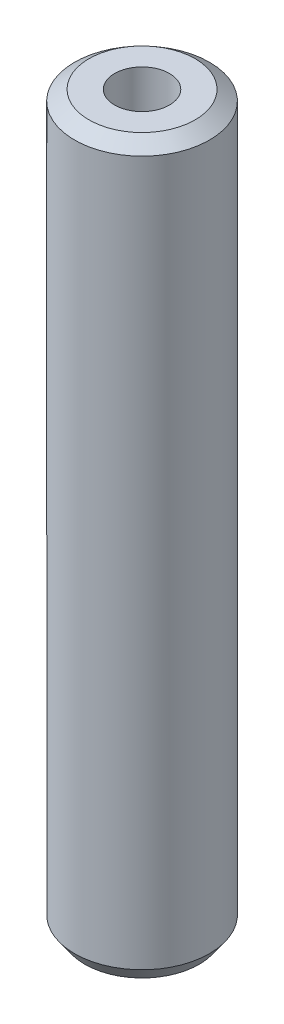
ISO-10303-21;
HEADER;
FILE_DESCRIPTION(('STEP AP214'),'2;1');
FILE_NAME('part.step','',(''),(''),'','','');
FILE_SCHEMA(('AUTOMOTIVE_DESIGN { 1 0 10303 214 1 1 1 1 }'));
ENDSEC;
DATA;
#1=APPLICATION_CONTEXT('core data for automotive mechanical design processes');
#2=APPLICATION_PROTOCOL_DEFINITION('international standard','automotive_design',2000,#1);
#3=PRODUCT_CONTEXT('',#1,'mechanical');
#4=PRODUCT('Part','Part','',(#3));
#5=PRODUCT_RELATED_PRODUCT_CATEGORY('part','',(#4));
#6=PRODUCT_DEFINITION_FORMATION('','',#4);
#7=PRODUCT_DEFINITION_CONTEXT('part definition',#1,'design');
#8=PRODUCT_DEFINITION('design','',#6,#7);
#9=PRODUCT_DEFINITION_SHAPE('','',#8);
#10=(LENGTH_UNIT() NAMED_UNIT(*) SI_UNIT(.MILLI.,.METRE.));
#11=(NAMED_UNIT(*) PLANE_ANGLE_UNIT() SI_UNIT($,.RADIAN.));
#12=(NAMED_UNIT(*) SI_UNIT($,.STERADIAN.) SOLID_ANGLE_UNIT());
#13=UNCERTAINTY_MEASURE_WITH_UNIT(LENGTH_MEASURE(1.E-05),#10,'distance_accuracy_value','');
#14=(GEOMETRIC_REPRESENTATION_CONTEXT(3) GLOBAL_UNCERTAINTY_ASSIGNED_CONTEXT((#13)) GLOBAL_UNIT_ASSIGNED_CONTEXT((#10,
#11,#12)) REPRESENTATION_CONTEXT('',''));
#15=CARTESIAN_POINT('',(0.,0.,0.));
#16=DIRECTION('',(0.,0.,1.));
#17=DIRECTION('',(1.,0.,0.));
#18=AXIS2_PLACEMENT_3D('',#15,#16,#17);
#19=CARTESIAN_POINT('',(0.,324.345287152873,0.));
#20=DIRECTION('',(0.,-1.,0.));
#21=DIRECTION('',(0.,0.,-1.));
#22=AXIS2_PLACEMENT_3D('',#19,#20,#21);
#23=CYLINDRICAL_SURFACE('',#22,30.);
#24=CARTESIAN_POINT('',(0.,319.780055287679,0.));
#25=DIRECTION('',(0.,1.,0.));
#26=DIRECTION('',(0.,0.,1.));
#27=AXIS2_PLACEMENT_3D('',#24,#25,#26);
#28=CIRCLE('',#27,30.);
#29=CARTESIAN_POINT('',(0.,319.780055287678,-30.));
#30=VERTEX_POINT('',#29);
#31=EDGE_CURVE('E50',#30,#30,#28,.F.);
#32=ORIENTED_EDGE('',*,*,#31,.T.);
#33=EDGE_LOOP('',(#32));
#34=FACE_BOUND('',#33,.T.);
#35=CARTESIAN_POINT('',(0.,6.40634981049937,0.));
#36=DIRECTION('',(0.,1.,0.));
#37=DIRECTION('',(0.,0.,1.));
#38=AXIS2_PLACEMENT_3D('',#35,#36,#37);
#39=CIRCLE('',#38,30.);
#40=CARTESIAN_POINT('',(0.,6.40634981049937,30.));
#41=VERTEX_POINT('',#40);
#42=EDGE_CURVE('E51',#41,#41,#39,.T.);
#43=ORIENTED_EDGE('',*,*,#42,.T.);
#44=EDGE_LOOP('',(#43));
#45=FACE_BOUND('',#44,.T.);
#46=ADVANCED_FACE('F39',(#34,#45),#23,.T.);
#47=CARTESIAN_POINT('',(0.,324.345287152873,0.));
#48=DIRECTION('',(0.,1.,0.));
#49=DIRECTION('',(0.,0.,1.));
#50=AXIS2_PLACEMENT_3D('',#47,#48,#49);
#51=PLANE('',#50);
#52=CARTESIAN_POINT('',(0.,324.345287152873,0.));
#53=DIRECTION('',(0.,1.,0.));
#54=DIRECTION('',(0.,0.,1.));
#55=AXIS2_PLACEMENT_3D('',#52,#53,#54);
#56=CIRCLE('',#55,23.5936501895005);
#57=CARTESIAN_POINT('',(0.,324.345287152872,-23.5936501895006));
#58=VERTEX_POINT('',#57);
#59=EDGE_CURVE('E54',#58,#58,#56,.T.);
#60=ORIENTED_EDGE('',*,*,#59,.T.);
#61=EDGE_LOOP('',(#60));
#62=FACE_BOUND('',#61,.T.);
#63=CARTESIAN_POINT('',(0.,324.345287152873,0.));
#64=DIRECTION('',(0.,1.,0.));
#65=DIRECTION('',(0.,0.,1.));
#66=AXIS2_PLACEMENT_3D('',#63,#64,#65);
#67=CIRCLE('',#66,12.1882427561408);
#68=CARTESIAN_POINT('',(0.,324.345287152873,12.1882427561408));
#69=VERTEX_POINT('',#68);
#70=EDGE_CURVE('E58',#69,#69,#67,.T.);
#71=ORIENTED_EDGE('',*,*,#70,.F.);
#72=EDGE_LOOP('',(#71));
#73=FACE_BOUND('',#72,.T.);
#74=ADVANCED_FACE('F69',(#62,#73),#51,.T.);
#75=CARTESIAN_POINT('',(0.,0.,0.));
#76=DIRECTION('',(0.,1.,0.));
#77=DIRECTION('',(0.,0.,1.));
#78=AXIS2_PLACEMENT_3D('',#75,#76,#77);
#79=PLANE('',#78);
#80=CARTESIAN_POINT('',(0.,0.,0.));
#81=DIRECTION('',(0.,1.,0.));
#82=DIRECTION('',(0.,0.,1.));
#83=AXIS2_PLACEMENT_3D('',#80,#81,#82);
#84=CIRCLE('',#83,25.434768134806);
#85=CARTESIAN_POINT('',(0.,0.,25.434768134806));
#86=VERTEX_POINT('',#85);
#87=EDGE_CURVE('E10',#86,#86,#84,.F.);
#88=ORIENTED_EDGE('',*,*,#87,.T.);
#89=EDGE_LOOP('',(#88));
#90=FACE_BOUND('',#89,.T.);
#91=CARTESIAN_POINT('',(0.,0.,0.));
#92=DIRECTION('',(0.,1.,0.));
#93=DIRECTION('',(0.,0.,1.));
#94=AXIS2_PLACEMENT_3D('',#91,#92,#93);
#95=CIRCLE('',#94,12.1882427561408);
#96=CARTESIAN_POINT('',(0.,0.,12.1882427561408));
#97=VERTEX_POINT('',#96);
#98=EDGE_CURVE('E63',#97,#97,#95,.T.);
#99=ORIENTED_EDGE('',*,*,#98,.T.);
#100=EDGE_LOOP('',(#99));
#101=FACE_BOUND('',#100,.T.);
#102=ADVANCED_FACE('F75',(#90,#101),#79,.F.);
#103=CARTESIAN_POINT('',(0.,324.345287152873,0.));
#104=DIRECTION('',(0.,-1.,0.));
#105=DIRECTION('',(0.,0.,-1.));
#106=AXIS2_PLACEMENT_3D('',#103,#104,#105);
#107=CYLINDRICAL_SURFACE('',#106,12.1882427561408);
#108=ORIENTED_EDGE('',*,*,#70,.T.);
#109=EDGE_LOOP('',(#108));
#110=FACE_BOUND('',#109,.T.);
#111=ORIENTED_EDGE('',*,*,#98,.F.);
#112=EDGE_LOOP('',(#111));
#113=FACE_BOUND('',#112,.T.);
#114=ADVANCED_FACE('F70',(#110,#113),#107,.F.);
#115=CARTESIAN_POINT('',(0.,324.345287152873,0.));
#116=DIRECTION('',(0.,-1.,0.));
#117=DIRECTION('',(0.,0.,-1.));
#118=AXIS2_PLACEMENT_3D('',#115,#116,#117);
#119=CONICAL_SURFACE('',#118,23.5936501895005,0.951657012088737);
#120=CARTESIAN_POINT('',(0.,319.780055287678,-30.));
#121=CARTESIAN_POINT('',(0.,319.827609786274,-29.933267189474));
#122=CARTESIAN_POINT('',(0.,319.87516428487,-29.866534378948));
#123=CARTESIAN_POINT('',(0.,319.970273282062,-29.7330687578959));
#124=CARTESIAN_POINT('',(0.,320.017827780657,-29.6663359473699));
#125=CARTESIAN_POINT('',(0.,320.112936777849,-29.5328703263178));
#126=CARTESIAN_POINT('',(0.,320.160491276445,-29.4661375157918));
#127=CARTESIAN_POINT('',(0.,320.255600273636,-29.3326718947397));
#128=CARTESIAN_POINT('',(0.,320.303154772232,-29.2659390842136));
#129=CARTESIAN_POINT('',(0.,320.398263769423,-29.1324734631616));
#130=CARTESIAN_POINT('',(0.,320.445818268019,-29.0657406526355));
#131=CARTESIAN_POINT('',(0.,320.540927265211,-28.9322750315835));
#132=CARTESIAN_POINT('',(0.,320.588481763807,-28.8655422210574));
#133=CARTESIAN_POINT('',(0.,320.683590760998,-28.7320766000053));
#134=CARTESIAN_POINT('',(0.,320.731145259594,-28.6653437894793));
#135=CARTESIAN_POINT('',(0.,320.826254256785,-28.5318781684273));
#136=CARTESIAN_POINT('',(0.,320.873808755381,-28.4651453579012));
#137=CARTESIAN_POINT('',(0.,320.968917752573,-28.3316797368491));
#138=CARTESIAN_POINT('',(0.,321.016472251169,-28.2649469263231));
#139=CARTESIAN_POINT('',(0.,321.11158124836,-28.131481305271));
#140=CARTESIAN_POINT('',(0.,321.159135746956,-28.064748494745));
#141=CARTESIAN_POINT('',(0.,321.254244744147,-27.9312828736929));
#142=CARTESIAN_POINT('',(0.,321.301799242743,-27.8645500631669));
#143=CARTESIAN_POINT('',(0.,321.396908239935,-27.7310844421148));
#144=CARTESIAN_POINT('',(0.,321.44446273853,-27.6643516315888));
#145=CARTESIAN_POINT('',(0.,321.539571735722,-27.5308860105367));
#146=CARTESIAN_POINT('',(0.,321.587126234318,-27.4641532000107));
#147=CARTESIAN_POINT('',(0.,321.682235231509,-27.3306875789586));
#148=CARTESIAN_POINT('',(0.,321.729789730105,-27.2639547684326));
#149=CARTESIAN_POINT('',(0.,321.824898727297,-27.1304891473805));
#150=CARTESIAN_POINT('',(0.,321.872453225892,-27.0637563368545));
#151=CARTESIAN_POINT('',(0.,321.967562223084,-26.9302907158024));
#152=CARTESIAN_POINT('',(0.,322.01511672168,-26.8635579052764));
#153=CARTESIAN_POINT('',(0.,322.110225718871,-26.7300922842243));
#154=CARTESIAN_POINT('',(0.,322.157780217467,-26.6633594736982));
#155=CARTESIAN_POINT('',(0.,322.252889214659,-26.5298938526462));
#156=CARTESIAN_POINT('',(0.,322.300443713254,-26.4631610421201));
#157=CARTESIAN_POINT('',(0.,322.395552710446,-26.3296954210681));
#158=CARTESIAN_POINT('',(0.,322.443107209042,-26.262962610542));
#159=CARTESIAN_POINT('',(0.,322.538216206233,-26.1294969894899));
#160=CARTESIAN_POINT('',(0.,322.585770704829,-26.0627641789639));
#161=CARTESIAN_POINT('',(0.,322.680879702021,-25.9292985579118));
#162=CARTESIAN_POINT('',(0.,322.728434200616,-25.8625657473858));
#163=CARTESIAN_POINT('',(0.,322.823543197808,-25.7291001263337));
#164=CARTESIAN_POINT('',(0.,322.871097696404,-25.6623673158077));
#165=CARTESIAN_POINT('',(0.,322.966206693595,-25.5289016947556));
#166=CARTESIAN_POINT('',(0.,323.013761192191,-25.4621688842296));
#167=CARTESIAN_POINT('',(0.,323.108870189382,-25.3287032631775));
#168=CARTESIAN_POINT('',(0.,323.156424687978,-25.2619704526515));
#169=CARTESIAN_POINT('',(0.,323.25153368517,-25.1285048315994));
#170=CARTESIAN_POINT('',(0.,323.299088183765,-25.0617720210734));
#171=CARTESIAN_POINT('',(0.,323.394197180957,-24.9283064000213));
#172=CARTESIAN_POINT('',(0.,323.441751679553,-24.8615735894953));
#173=CARTESIAN_POINT('',(0.,323.536860676744,-24.7281079684432));
#174=CARTESIAN_POINT('',(0.,323.58441517534,-24.6613751579172));
#175=CARTESIAN_POINT('',(0.,323.679524172532,-24.5279095368651));
#176=CARTESIAN_POINT('',(0.,323.727078671128,-24.4611767263391));
#177=CARTESIAN_POINT('',(0.,323.822187668319,-24.327711105287));
#178=CARTESIAN_POINT('',(0.,323.869742166915,-24.2609782947609));
#179=CARTESIAN_POINT('',(0.,323.964851164106,-24.1275126737089));
#180=CARTESIAN_POINT('',(0.,324.012405662702,-24.0607798631828));
#181=CARTESIAN_POINT('',(0.,324.107514659894,-23.9273142421308));
#182=CARTESIAN_POINT('',(0.,324.155069158489,-23.8605814316047));
#183=CARTESIAN_POINT('',(0.,324.250178155681,-23.7271158105527));
#184=CARTESIAN_POINT('',(0.,324.297732654277,-23.6603830000266));
#185=CARTESIAN_POINT('',(0.,324.345287152873,-23.5936501895006));
#186=B_SPLINE_CURVE_WITH_KNOTS('',3,(#120,#121,#122,#123,#124,#125,#126,#127,#128,#129,#130,
#131,#132,#133,#134,#135,#136,#137,#138,#139,#140,#141,#142,#143,#144,#145,#146,#147,#148,#149,
#150,#151,#152,#153,#154,#155,#156,#157,#158,#159,#160,#161,#162,#163,#164,#165,#166,#167,#168,
#169,#170,#171,#172,#173,#174,#175,#176,#177,#178,#179,#180,#181,#182,#183,#184,#185),
.UNSPECIFIED.,.F.,.F.,(4,2,2,2,2,2,2,2,2,2,2,2,2,2,2,2,2,2,2,2,2,2,2,2,2,2,2,2,2,2,2,2,4),(0.,
0.245829788749451,0.491659577498871,0.737489366248319,0.983319154997738,1.22914894374719,
1.47497873249661,1.72080852124606,1.96663830999548,2.21246809874493,2.45829788749435,
2.7041276762438,2.94995746499322,3.19578725374267,3.44161704249208,3.68744683124154,
3.93327661999095,4.17910640874037,4.42493619748982,4.67076598623924,4.91659577498869,
5.16242556373811,5.40825535248756,5.65408514123698,5.89991492998643,6.14574471873585,
6.3915745074853,6.63740429623472,6.88323408498417,7.12906387373359,7.37489366248304,
7.62072345123246,7.86655323998191),.UNSPECIFIED.);
#187=EDGE_CURVE('BSEAM81',#30,#58,#186,.T.);
#188=ORIENTED_EDGE('',*,*,#31,.F.);
#189=ORIENTED_EDGE('',*,*,#59,.F.);
#190=ORIENTED_EDGE('',*,*,#187,.T.);
#191=ORIENTED_EDGE('',*,*,#187,.F.);
#192=EDGE_LOOP('',(#188,#190,#189,#191));
#193=FACE_BOUND('',#192,.T.);
#194=ADVANCED_FACE('F81',(#193),#119,.T.);
#195=CARTESIAN_POINT('',(0.,6.40634981049937,0.));
#196=DIRECTION('',(0.,1.,0.));
#197=DIRECTION('',(0.,0.,1.));
#198=AXIS2_PLACEMENT_3D('',#195,#196,#197);
#199=CONICAL_SURFACE('',#198,30.,0.619139314706157);
#200=ORIENTED_EDGE('',*,*,#87,.F.);
#201=EDGE_LOOP('',(#200));
#202=FACE_BOUND('',#201,.T.);
#203=ORIENTED_EDGE('',*,*,#42,.F.);
#204=EDGE_LOOP('',(#203));
#205=FACE_BOUND('',#204,.T.);
#206=ADVANCED_FACE('F45',(#202,#205),#199,.T.);
#207=CLOSED_SHELL('',(#46,#74,#102,#114,#194,#206));
#208=MANIFOLD_SOLID_BREP('B2',#207);
#209=ADVANCED_BREP_SHAPE_REPRESENTATION('',(#18,#208),#14);
#210=SHAPE_DEFINITION_REPRESENTATION(#9,#209);
ENDSEC;
END-ISO-10303-21;
